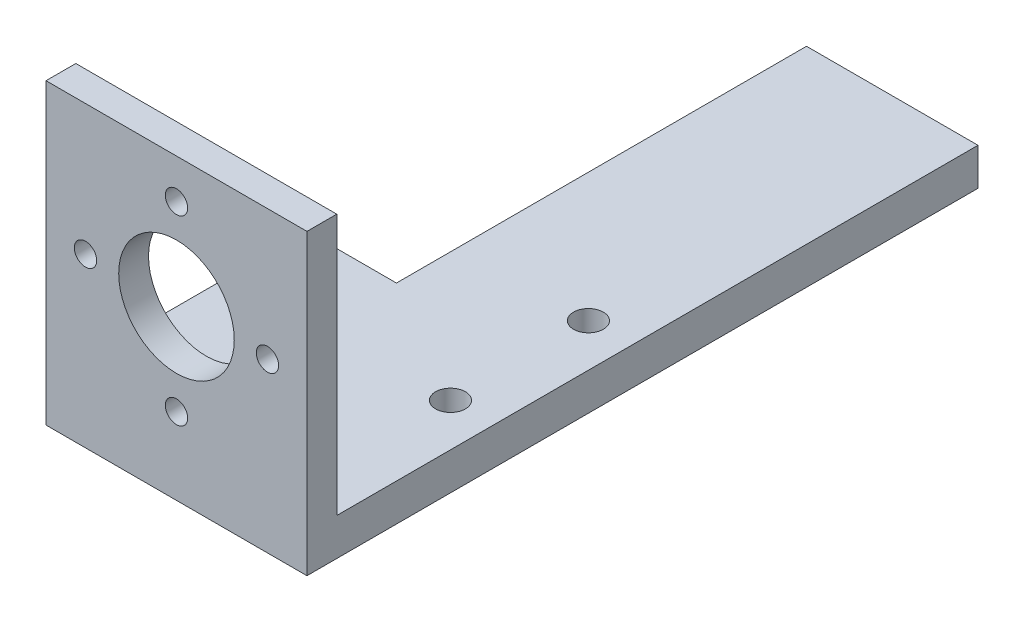
ISO-10303-21;
HEADER;
FILE_DESCRIPTION(('STEP AP214'),'2;1');
FILE_NAME('part.step','',(''),(''),'','','');
FILE_SCHEMA(('AUTOMOTIVE_DESIGN { 1 0 10303 214 1 1 1 1 }'));
ENDSEC;
DATA;
#1=APPLICATION_CONTEXT('core data for automotive mechanical design processes');
#2=APPLICATION_PROTOCOL_DEFINITION('international standard','automotive_design',2000,#1);
#3=PRODUCT_CONTEXT('',#1,'mechanical');
#4=PRODUCT('Part','Part','',(#3));
#5=PRODUCT_RELATED_PRODUCT_CATEGORY('part','',(#4));
#6=PRODUCT_DEFINITION_FORMATION('','',#4);
#7=PRODUCT_DEFINITION_CONTEXT('part definition',#1,'design');
#8=PRODUCT_DEFINITION('design','',#6,#7);
#9=PRODUCT_DEFINITION_SHAPE('','',#8);
#10=(LENGTH_UNIT() NAMED_UNIT(*) SI_UNIT(.MILLI.,.METRE.));
#11=(NAMED_UNIT(*) PLANE_ANGLE_UNIT() SI_UNIT($,.RADIAN.));
#12=(NAMED_UNIT(*) SI_UNIT($,.STERADIAN.) SOLID_ANGLE_UNIT());
#13=UNCERTAINTY_MEASURE_WITH_UNIT(LENGTH_MEASURE(1.E-05),#10,'distance_accuracy_value','');
#14=(GEOMETRIC_REPRESENTATION_CONTEXT(3) GLOBAL_UNCERTAINTY_ASSIGNED_CONTEXT((#13)) GLOBAL_UNIT_ASSIGNED_CONTEXT((#10,
#11,#12)) REPRESENTATION_CONTEXT('',''));
#15=CARTESIAN_POINT('',(0.,0.,0.));
#16=DIRECTION('',(0.,0.,1.));
#17=DIRECTION('',(1.,0.,0.));
#18=AXIS2_PLACEMENT_3D('',#15,#16,#17);
#19=CARTESIAN_POINT('',(-5.5,2.5,0.));
#20=DIRECTION('',(-1.,0.,0.));
#21=DIRECTION('',(0.,0.,1.));
#22=AXIS2_PLACEMENT_3D('',#19,#20,#21);
#23=PLANE('',#22);
#24=DIRECTION('',(0.,0.,-1.));
#25=VECTOR('',#24,1.);
#26=CARTESIAN_POINT('',(-5.5,-2.5,0.));
#27=LINE('',#26,#25);
#28=CARTESIAN_POINT('',(-5.5,-2.5,10.));
#29=VERTEX_POINT('',#28);
#30=CARTESIAN_POINT('',(-5.5,-2.5,-45.));
#31=VERTEX_POINT('',#30);
#32=EDGE_CURVE('E173',#29,#31,#27,.T.);
#33=ORIENTED_EDGE('',*,*,#32,.F.);
#34=DIRECTION('',(0.,-1.,0.));
#35=VECTOR('',#34,1.);
#36=CARTESIAN_POINT('',(-5.5,2.5,10.));
#37=LINE('',#36,#35);
#38=CARTESIAN_POINT('',(-5.5,2.5,10.));
#39=VERTEX_POINT('',#38);
#40=EDGE_CURVE('E11',#39,#29,#37,.T.);
#41=ORIENTED_EDGE('',*,*,#40,.F.);
#42=DIRECTION('',(0.,0.,-1.));
#43=VECTOR('',#42,1.);
#44=CARTESIAN_POINT('',(-5.5,2.5,0.));
#45=LINE('',#44,#43);
#46=CARTESIAN_POINT('',(-5.5,2.5,-45.));
#47=VERTEX_POINT('',#46);
#48=EDGE_CURVE('E154',#39,#47,#45,.T.);
#49=ORIENTED_EDGE('',*,*,#48,.T.);
#50=DIRECTION('',(0.,-1.,0.));
#51=VECTOR('',#50,1.);
#52=CARTESIAN_POINT('',(-5.5,2.5,-45.));
#53=LINE('',#52,#51);
#54=EDGE_CURVE('E59',#47,#31,#53,.T.);
#55=ORIENTED_EDGE('',*,*,#54,.T.);
#56=EDGE_LOOP('',(#33,#41,#49,#55));
#57=FACE_BOUND('',#56,.T.);
#58=ADVANCED_FACE('F35',(#57),#23,.T.);
#59=CARTESIAN_POINT('',(0.,2.5,10.));
#60=DIRECTION('',(0.,0.,-1.));
#61=DIRECTION('',(-1.,0.,0.));
#62=AXIS2_PLACEMENT_3D('',#59,#60,#61);
#63=PLANE('',#62);
#64=DIRECTION('',(1.,0.,0.));
#65=VECTOR('',#64,1.);
#66=CARTESIAN_POINT('',(0.,-2.5,10.));
#67=LINE('',#66,#65);
#68=CARTESIAN_POINT('',(-17.5,-2.5,10.));
#69=VERTEX_POINT('',#68);
#70=EDGE_CURVE('E175',#69,#29,#67,.T.);
#71=ORIENTED_EDGE('',*,*,#70,.F.);
#72=DIRECTION('',(0.,-1.,0.));
#73=VECTOR('',#72,1.);
#74=CARTESIAN_POINT('',(-17.5,2.5,10.));
#75=LINE('',#74,#73);
#76=CARTESIAN_POINT('',(-17.5,2.5,10.));
#77=VERTEX_POINT('',#76);
#78=EDGE_CURVE('E43',#77,#69,#75,.T.);
#79=ORIENTED_EDGE('',*,*,#78,.F.);
#80=DIRECTION('',(1.,0.,0.));
#81=VECTOR('',#80,1.);
#82=CARTESIAN_POINT('',(0.,2.5,10.));
#83=LINE('',#82,#81);
#84=EDGE_CURVE('E156',#77,#39,#83,.T.);
#85=ORIENTED_EDGE('',*,*,#84,.T.);
#86=ORIENTED_EDGE('',*,*,#40,.T.);
#87=EDGE_LOOP('',(#71,#79,#85,#86));
#88=FACE_BOUND('',#87,.T.);
#89=ADVANCED_FACE('F193',(#88),#63,.T.);
#90=CARTESIAN_POINT('',(-17.5,2.5,0.));
#91=DIRECTION('',(-1.,0.,0.));
#92=DIRECTION('',(0.,0.,1.));
#93=AXIS2_PLACEMENT_3D('',#90,#91,#92);
#94=PLANE('',#93);
#95=DIRECTION('',(0.,0.,-1.));
#96=VECTOR('',#95,1.);
#97=CARTESIAN_POINT('',(-17.5,-2.5,0.));
#98=LINE('',#97,#96);
#99=CARTESIAN_POINT('',(-17.5,-2.5,45.));
#100=VERTEX_POINT('',#99);
#101=EDGE_CURVE('E112',#100,#69,#98,.T.);
#102=ORIENTED_EDGE('',*,*,#101,.F.);
#103=DIRECTION('',(0.,-1.,0.));
#104=VECTOR('',#103,1.);
#105=CARTESIAN_POINT('',(-17.5,2.5,45.));
#106=LINE('',#105,#104);
#107=CARTESIAN_POINT('',(-17.5,37.5,45.));
#108=VERTEX_POINT('',#107);
#109=EDGE_CURVE('E105',#108,#100,#106,.T.);
#110=ORIENTED_EDGE('',*,*,#109,.F.);
#111=DIRECTION('',(0.,0.,1.));
#112=VECTOR('',#111,1.);
#113=CARTESIAN_POINT('',(-17.5,37.5,41.));
#114=LINE('',#113,#112);
#115=CARTESIAN_POINT('',(-17.5,37.5,41.));
#116=VERTEX_POINT('',#115);
#117=EDGE_CURVE('E110',#116,#108,#114,.T.);
#118=ORIENTED_EDGE('',*,*,#117,.F.);
#119=DIRECTION('',(0.,-1.,0.));
#120=VECTOR('',#119,1.);
#121=CARTESIAN_POINT('',(-17.5,37.5,41.));
#122=LINE('',#121,#120);
#123=CARTESIAN_POINT('',(-17.5,2.5,41.));
#124=VERTEX_POINT('',#123);
#125=EDGE_CURVE('E137',#116,#124,#122,.T.);
#126=ORIENTED_EDGE('',*,*,#125,.T.);
#127=DIRECTION('',(0.,0.,-1.));
#128=VECTOR('',#127,1.);
#129=CARTESIAN_POINT('',(-17.5,2.5,0.));
#130=LINE('',#129,#128);
#131=EDGE_CURVE('E159',#124,#77,#130,.T.);
#132=ORIENTED_EDGE('',*,*,#131,.T.);
#133=ORIENTED_EDGE('',*,*,#78,.T.);
#134=EDGE_LOOP('',(#102,#110,#118,#126,#132,#133));
#135=FACE_BOUND('',#134,.T.);
#136=ADVANCED_FACE('F107',(#135),#94,.T.);
#137=CARTESIAN_POINT('',(0.,2.5,45.));
#138=DIRECTION('',(0.,0.,1.));
#139=DIRECTION('',(1.,0.,0.));
#140=AXIS2_PLACEMENT_3D('',#137,#138,#139);
#141=PLANE('',#140);
#142=CARTESIAN_POINT('',(0.,32.2,45.));
#143=DIRECTION('',(0.,0.,1.));
#144=DIRECTION('',(1.,0.,0.));
#145=AXIS2_PLACEMENT_3D('',#142,#143,#144);
#146=CIRCLE('',#145,1.5);
#147=CARTESIAN_POINT('',(1.50000000000001,32.2,45.));
#148=VERTEX_POINT('',#147);
#149=EDGE_CURVE('E382',#148,#148,#146,.F.);
#150=ORIENTED_EDGE('',*,*,#149,.T.);
#151=EDGE_LOOP('',(#150));
#152=FACE_BOUND('',#151,.T.);
#153=CARTESIAN_POINT('',(12.2,20.,45.));
#154=DIRECTION('',(0.,0.,1.));
#155=DIRECTION('',(1.,0.,0.));
#156=AXIS2_PLACEMENT_3D('',#153,#154,#155);
#157=CIRCLE('',#156,1.5);
#158=CARTESIAN_POINT('',(13.7,20.,45.));
#159=VERTEX_POINT('',#158);
#160=EDGE_CURVE('E397',#159,#159,#157,.F.);
#161=ORIENTED_EDGE('',*,*,#160,.T.);
#162=EDGE_LOOP('',(#161));
#163=FACE_BOUND('',#162,.T.);
#164=CARTESIAN_POINT('',(0.,7.80000000000001,45.));
#165=DIRECTION('',(0.,0.,1.));
#166=DIRECTION('',(1.,0.,0.));
#167=AXIS2_PLACEMENT_3D('',#164,#165,#166);
#168=CIRCLE('',#167,1.5);
#169=CARTESIAN_POINT('',(1.50000000000001,7.80000000000001,45.));
#170=VERTEX_POINT('',#169);
#171=EDGE_CURVE('E391',#170,#170,#168,.F.);
#172=ORIENTED_EDGE('',*,*,#171,.T.);
#173=EDGE_LOOP('',(#172));
#174=FACE_BOUND('',#173,.T.);
#175=CARTESIAN_POINT('',(-12.2,20.,45.));
#176=DIRECTION('',(0.,0.,1.));
#177=DIRECTION('',(1.,0.,0.));
#178=AXIS2_PLACEMENT_3D('',#175,#176,#177);
#179=CIRCLE('',#178,1.5);
#180=CARTESIAN_POINT('',(-10.7,20.,45.));
#181=VERTEX_POINT('',#180);
#182=EDGE_CURVE('E133',#181,#181,#179,.F.);
#183=ORIENTED_EDGE('',*,*,#182,.T.);
#184=EDGE_LOOP('',(#183));
#185=FACE_BOUND('',#184,.T.);
#186=CARTESIAN_POINT('',(0.,20.,45.));
#187=DIRECTION('',(0.,0.,1.));
#188=DIRECTION('',(1.,0.,0.));
#189=AXIS2_PLACEMENT_3D('',#186,#187,#188);
#190=CIRCLE('',#189,7.75);
#191=CARTESIAN_POINT('',(7.75000000000001,20.,45.));
#192=VERTEX_POINT('',#191);
#193=EDGE_CURVE('E402',#192,#192,#190,.F.);
#194=ORIENTED_EDGE('',*,*,#193,.T.);
#195=EDGE_LOOP('',(#194));
#196=FACE_BOUND('',#195,.T.);
#197=DIRECTION('',(-1.,0.,0.));
#198=VECTOR('',#197,1.);
#199=CARTESIAN_POINT('',(0.,-2.5,45.));
#200=LINE('',#199,#198);
#201=CARTESIAN_POINT('',(17.5,-2.5,45.));
#202=VERTEX_POINT('',#201);
#203=EDGE_CURVE('E179',#202,#100,#200,.T.);
#204=ORIENTED_EDGE('',*,*,#203,.F.);
#205=DIRECTION('',(0.,-1.,0.));
#206=VECTOR('',#205,1.);
#207=CARTESIAN_POINT('',(17.5,2.5,45.));
#208=LINE('',#207,#206);
#209=CARTESIAN_POINT('',(17.5,37.5,45.));
#210=VERTEX_POINT('',#209);
#211=EDGE_CURVE('E116',#210,#202,#208,.T.);
#212=ORIENTED_EDGE('',*,*,#211,.F.);
#213=DIRECTION('',(1.,0.,0.));
#214=VECTOR('',#213,1.);
#215=CARTESIAN_POINT('',(-17.5,37.5,45.));
#216=LINE('',#215,#214);
#217=EDGE_CURVE('E119',#108,#210,#216,.T.);
#218=ORIENTED_EDGE('',*,*,#217,.F.);
#219=ORIENTED_EDGE('',*,*,#109,.T.);
#220=EDGE_LOOP('',(#204,#212,#218,#219));
#221=FACE_BOUND('',#220,.T.);
#222=ADVANCED_FACE('F120',(#152,#163,#174,#185,#196,#221),#141,.T.);
#223=CARTESIAN_POINT('',(17.5,2.5,0.));
#224=DIRECTION('',(1.,0.,0.));
#225=DIRECTION('',(0.,0.,-1.));
#226=AXIS2_PLACEMENT_3D('',#223,#224,#225);
#227=PLANE('',#226);
#228=DIRECTION('',(0.,0.,1.));
#229=VECTOR('',#228,1.);
#230=CARTESIAN_POINT('',(17.5,-2.5,0.));
#231=LINE('',#230,#229);
#232=CARTESIAN_POINT('',(17.5,-2.5,-45.));
#233=VERTEX_POINT('',#232);
#234=EDGE_CURVE('E181',#233,#202,#231,.T.);
#235=ORIENTED_EDGE('',*,*,#234,.F.);
#236=DIRECTION('',(0.,-1.,0.));
#237=VECTOR('',#236,1.);
#238=CARTESIAN_POINT('',(17.5,2.5,-45.));
#239=LINE('',#238,#237);
#240=CARTESIAN_POINT('',(17.5,2.5,-45.));
#241=VERTEX_POINT('',#240);
#242=EDGE_CURVE('E187',#241,#233,#239,.T.);
#243=ORIENTED_EDGE('',*,*,#242,.F.);
#244=DIRECTION('',(0.,0.,1.));
#245=VECTOR('',#244,1.);
#246=CARTESIAN_POINT('',(17.5,2.5,0.));
#247=LINE('',#246,#245);
#248=CARTESIAN_POINT('',(17.5,2.5,41.));
#249=VERTEX_POINT('',#248);
#250=EDGE_CURVE('E161',#241,#249,#247,.T.);
#251=ORIENTED_EDGE('',*,*,#250,.T.);
#252=DIRECTION('',(0.,-1.,0.));
#253=VECTOR('',#252,1.);
#254=CARTESIAN_POINT('',(17.5,37.5,41.));
#255=LINE('',#254,#253);
#256=CARTESIAN_POINT('',(17.5,37.5,41.));
#257=VERTEX_POINT('',#256);
#258=EDGE_CURVE('E140',#257,#249,#255,.T.);
#259=ORIENTED_EDGE('',*,*,#258,.F.);
#260=DIRECTION('',(0.,0.,-1.));
#261=VECTOR('',#260,1.);
#262=CARTESIAN_POINT('',(17.5,37.5,45.));
#263=LINE('',#262,#261);
#264=EDGE_CURVE('E123',#210,#257,#263,.T.);
#265=ORIENTED_EDGE('',*,*,#264,.F.);
#266=ORIENTED_EDGE('',*,*,#211,.T.);
#267=EDGE_LOOP('',(#235,#243,#251,#259,#265,#266));
#268=FACE_BOUND('',#267,.T.);
#269=ADVANCED_FACE('F198',(#268),#227,.T.);
#270=CARTESIAN_POINT('',(-11.75,2.5,20.));
#271=DIRECTION('',(0.,-1.,0.));
#272=DIRECTION('',(0.,0.,-1.));
#273=AXIS2_PLACEMENT_3D('',#270,#271,#272);
#274=CYLINDRICAL_SURFACE('',#273,2.);
#275=CARTESIAN_POINT('',(-11.75,2.5,20.));
#276=DIRECTION('',(0.,1.,0.));
#277=DIRECTION('',(0.,0.,1.));
#278=AXIS2_PLACEMENT_3D('',#275,#276,#277);
#279=CIRCLE('',#278,2.);
#280=CARTESIAN_POINT('',(-11.75,2.5,22.));
#281=VERTEX_POINT('',#280);
#282=EDGE_CURVE('E151',#281,#281,#279,.T.);
#283=ORIENTED_EDGE('',*,*,#282,.T.);
#284=EDGE_LOOP('',(#283));
#285=FACE_BOUND('',#284,.T.);
#286=CARTESIAN_POINT('',(-11.75,-2.5,20.));
#287=DIRECTION('',(0.,1.,0.));
#288=DIRECTION('',(0.,0.,1.));
#289=AXIS2_PLACEMENT_3D('',#286,#287,#288);
#290=CIRCLE('',#289,2.);
#291=CARTESIAN_POINT('',(-11.75,-2.5,22.));
#292=VERTEX_POINT('',#291);
#293=EDGE_CURVE('E170',#292,#292,#290,.T.);
#294=ORIENTED_EDGE('',*,*,#293,.F.);
#295=EDGE_LOOP('',(#294));
#296=FACE_BOUND('',#295,.T.);
#297=ADVANCED_FACE('F225',(#285,#296),#274,.F.);
#298=CARTESIAN_POINT('',(11.75,2.5,1.5));
#299=DIRECTION('',(0.,-1.,0.));
#300=DIRECTION('',(0.,0.,-1.));
#301=AXIS2_PLACEMENT_3D('',#298,#299,#300);
#302=CYLINDRICAL_SURFACE('',#301,2.);
#303=CARTESIAN_POINT('',(11.75,2.5,1.5));
#304=DIRECTION('',(0.,1.,0.));
#305=DIRECTION('',(0.,0.,1.));
#306=AXIS2_PLACEMENT_3D('',#303,#304,#305);
#307=CIRCLE('',#306,2.);
#308=CARTESIAN_POINT('',(11.75,2.5,3.5));
#309=VERTEX_POINT('',#308);
#310=EDGE_CURVE('E147',#309,#309,#307,.T.);
#311=ORIENTED_EDGE('',*,*,#310,.T.);
#312=EDGE_LOOP('',(#311));
#313=FACE_BOUND('',#312,.T.);
#314=CARTESIAN_POINT('',(11.75,-2.5,1.5));
#315=DIRECTION('',(0.,1.,0.));
#316=DIRECTION('',(0.,0.,1.));
#317=AXIS2_PLACEMENT_3D('',#314,#315,#316);
#318=CIRCLE('',#317,2.);
#319=CARTESIAN_POINT('',(11.75,-2.5,3.5));
#320=VERTEX_POINT('',#319);
#321=EDGE_CURVE('E167',#320,#320,#318,.T.);
#322=ORIENTED_EDGE('',*,*,#321,.F.);
#323=EDGE_LOOP('',(#322));
#324=FACE_BOUND('',#323,.T.);
#325=ADVANCED_FACE('F227',(#313,#324),#302,.F.);
#326=CARTESIAN_POINT('',(11.75,2.5,20.));
#327=DIRECTION('',(0.,-1.,0.));
#328=DIRECTION('',(0.,0.,-1.));
#329=AXIS2_PLACEMENT_3D('',#326,#327,#328);
#330=CYLINDRICAL_SURFACE('',#329,2.);
#331=CARTESIAN_POINT('',(11.75,2.5,20.));
#332=DIRECTION('',(0.,1.,0.));
#333=DIRECTION('',(0.,0.,1.));
#334=AXIS2_PLACEMENT_3D('',#331,#332,#333);
#335=CIRCLE('',#334,2.);
#336=CARTESIAN_POINT('',(11.75,2.5,22.));
#337=VERTEX_POINT('',#336);
#338=EDGE_CURVE('E144',#337,#337,#335,.T.);
#339=ORIENTED_EDGE('',*,*,#338,.T.);
#340=EDGE_LOOP('',(#339));
#341=FACE_BOUND('',#340,.T.);
#342=CARTESIAN_POINT('',(11.75,-2.5,20.));
#343=DIRECTION('',(0.,1.,0.));
#344=DIRECTION('',(0.,0.,1.));
#345=AXIS2_PLACEMENT_3D('',#342,#343,#344);
#346=CIRCLE('',#345,2.);
#347=CARTESIAN_POINT('',(11.75,-2.5,22.));
#348=VERTEX_POINT('',#347);
#349=EDGE_CURVE('E143',#348,#348,#346,.T.);
#350=ORIENTED_EDGE('',*,*,#349,.F.);
#351=EDGE_LOOP('',(#350));
#352=FACE_BOUND('',#351,.T.);
#353=ADVANCED_FACE('F37',(#341,#352),#330,.F.);
#354=CARTESIAN_POINT('',(0.,2.5,-45.));
#355=DIRECTION('',(0.,0.,-1.));
#356=DIRECTION('',(-1.,0.,0.));
#357=AXIS2_PLACEMENT_3D('',#354,#355,#356);
#358=PLANE('',#357);
#359=DIRECTION('',(1.,0.,0.));
#360=VECTOR('',#359,1.);
#361=CARTESIAN_POINT('',(0.,-2.5,-45.));
#362=LINE('',#361,#360);
#363=EDGE_CURVE('E148',#31,#233,#362,.T.);
#364=ORIENTED_EDGE('',*,*,#363,.F.);
#365=ORIENTED_EDGE('',*,*,#54,.F.);
#366=DIRECTION('',(1.,0.,0.));
#367=VECTOR('',#366,1.);
#368=CARTESIAN_POINT('',(0.,2.5,-45.));
#369=LINE('',#368,#367);
#370=EDGE_CURVE('E163',#47,#241,#369,.T.);
#371=ORIENTED_EDGE('',*,*,#370,.T.);
#372=ORIENTED_EDGE('',*,*,#242,.T.);
#373=EDGE_LOOP('',(#364,#365,#371,#372));
#374=FACE_BOUND('',#373,.T.);
#375=ADVANCED_FACE('F234',(#374),#358,.T.);
#376=CARTESIAN_POINT('',(0.,2.5,0.));
#377=DIRECTION('',(0.,1.,0.));
#378=DIRECTION('',(0.,0.,1.));
#379=AXIS2_PLACEMENT_3D('',#376,#377,#378);
#380=PLANE('',#379);
#381=DIRECTION('',(-1.,0.,0.));
#382=VECTOR('',#381,1.);
#383=CARTESIAN_POINT('',(17.5,2.5,41.));
#384=LINE('',#383,#382);
#385=EDGE_CURVE('E50',#249,#124,#384,.T.);
#386=ORIENTED_EDGE('',*,*,#385,.F.);
#387=ORIENTED_EDGE('',*,*,#250,.F.);
#388=ORIENTED_EDGE('',*,*,#370,.F.);
#389=ORIENTED_EDGE('',*,*,#48,.F.);
#390=ORIENTED_EDGE('',*,*,#84,.F.);
#391=ORIENTED_EDGE('',*,*,#131,.F.);
#392=EDGE_LOOP('',(#386,#387,#388,#389,#390,#391));
#393=FACE_BOUND('',#392,.T.);
#394=ORIENTED_EDGE('',*,*,#338,.F.);
#395=EDGE_LOOP('',(#394));
#396=FACE_BOUND('',#395,.T.);
#397=ORIENTED_EDGE('',*,*,#310,.F.);
#398=EDGE_LOOP('',(#397));
#399=FACE_BOUND('',#398,.T.);
#400=ORIENTED_EDGE('',*,*,#282,.F.);
#401=EDGE_LOOP('',(#400));
#402=FACE_BOUND('',#401,.T.);
#403=ADVANCED_FACE('F211',(#393,#396,#399,#402),#380,.T.);
#404=CARTESIAN_POINT('',(0.,-2.5,0.));
#405=DIRECTION('',(0.,1.,0.));
#406=DIRECTION('',(0.,0.,1.));
#407=AXIS2_PLACEMENT_3D('',#404,#405,#406);
#408=PLANE('',#407);
#409=ORIENTED_EDGE('',*,*,#349,.T.);
#410=EDGE_LOOP('',(#409));
#411=FACE_BOUND('',#410,.T.);
#412=ORIENTED_EDGE('',*,*,#321,.T.);
#413=EDGE_LOOP('',(#412));
#414=FACE_BOUND('',#413,.T.);
#415=ORIENTED_EDGE('',*,*,#293,.T.);
#416=EDGE_LOOP('',(#415));
#417=FACE_BOUND('',#416,.T.);
#418=ORIENTED_EDGE('',*,*,#32,.T.);
#419=ORIENTED_EDGE('',*,*,#363,.T.);
#420=ORIENTED_EDGE('',*,*,#234,.T.);
#421=ORIENTED_EDGE('',*,*,#203,.T.);
#422=ORIENTED_EDGE('',*,*,#101,.T.);
#423=ORIENTED_EDGE('',*,*,#70,.T.);
#424=EDGE_LOOP('',(#418,#419,#420,#421,#422,#423));
#425=FACE_BOUND('',#424,.T.);
#426=ADVANCED_FACE('F195',(#411,#414,#417,#425),#408,.F.);
#427=CARTESIAN_POINT('',(17.5,37.5,41.));
#428=DIRECTION('',(0.,0.,1.));
#429=DIRECTION('',(1.,0.,0.));
#430=AXIS2_PLACEMENT_3D('',#427,#428,#429);
#431=PLANE('',#430);
#432=CARTESIAN_POINT('',(0.,32.2,41.));
#433=DIRECTION('',(0.,0.,-1.));
#434=DIRECTION('',(-1.,0.,0.));
#435=AXIS2_PLACEMENT_3D('',#432,#433,#434);
#436=CIRCLE('',#435,1.5);
#437=CARTESIAN_POINT('',(-1.49999999999999,32.2,41.));
#438=VERTEX_POINT('',#437);
#439=EDGE_CURVE('E130',#438,#438,#436,.T.);
#440=ORIENTED_EDGE('',*,*,#439,.F.);
#441=EDGE_LOOP('',(#440));
#442=FACE_BOUND('',#441,.T.);
#443=CARTESIAN_POINT('',(12.2,20.,41.));
#444=DIRECTION('',(0.,0.,-1.));
#445=DIRECTION('',(-1.,0.,0.));
#446=AXIS2_PLACEMENT_3D('',#443,#444,#445);
#447=CIRCLE('',#446,1.5);
#448=CARTESIAN_POINT('',(10.7,20.,41.));
#449=VERTEX_POINT('',#448);
#450=EDGE_CURVE('E394',#449,#449,#447,.T.);
#451=ORIENTED_EDGE('',*,*,#450,.F.);
#452=EDGE_LOOP('',(#451));
#453=FACE_BOUND('',#452,.T.);
#454=CARTESIAN_POINT('',(0.,7.80000000000001,41.));
#455=DIRECTION('',(0.,0.,-1.));
#456=DIRECTION('',(-1.,0.,0.));
#457=AXIS2_PLACEMENT_3D('',#454,#455,#456);
#458=CIRCLE('',#457,1.5);
#459=CARTESIAN_POINT('',(-1.49999999999999,7.80000000000001,41.));
#460=VERTEX_POINT('',#459);
#461=EDGE_CURVE('E388',#460,#460,#458,.T.);
#462=ORIENTED_EDGE('',*,*,#461,.F.);
#463=EDGE_LOOP('',(#462));
#464=FACE_BOUND('',#463,.T.);
#465=CARTESIAN_POINT('',(-12.2,20.,41.));
#466=DIRECTION('',(0.,0.,-1.));
#467=DIRECTION('',(-1.,0.,0.));
#468=AXIS2_PLACEMENT_3D('',#465,#466,#467);
#469=CIRCLE('',#468,1.5);
#470=CARTESIAN_POINT('',(-13.7,20.,41.));
#471=VERTEX_POINT('',#470);
#472=EDGE_CURVE('E404',#471,#471,#469,.T.);
#473=ORIENTED_EDGE('',*,*,#472,.F.);
#474=EDGE_LOOP('',(#473));
#475=FACE_BOUND('',#474,.T.);
#476=CARTESIAN_POINT('',(0.,20.,41.));
#477=DIRECTION('',(0.,0.,-1.));
#478=DIRECTION('',(-1.,0.,0.));
#479=AXIS2_PLACEMENT_3D('',#476,#477,#478);
#480=CIRCLE('',#479,7.75);
#481=CARTESIAN_POINT('',(-7.74999999999999,20.,41.));
#482=VERTEX_POINT('',#481);
#483=EDGE_CURVE('E385',#482,#482,#480,.T.);
#484=ORIENTED_EDGE('',*,*,#483,.F.);
#485=EDGE_LOOP('',(#484));
#486=FACE_BOUND('',#485,.T.);
#487=ORIENTED_EDGE('',*,*,#385,.T.);
#488=ORIENTED_EDGE('',*,*,#125,.F.);
#489=DIRECTION('',(-1.,0.,0.));
#490=VECTOR('',#489,1.);
#491=CARTESIAN_POINT('',(17.5,37.5,41.));
#492=LINE('',#491,#490);
#493=EDGE_CURVE('E127',#257,#116,#492,.T.);
#494=ORIENTED_EDGE('',*,*,#493,.F.);
#495=ORIENTED_EDGE('',*,*,#258,.T.);
#496=EDGE_LOOP('',(#487,#488,#494,#495));
#497=FACE_BOUND('',#496,.T.);
#498=ADVANCED_FACE('F201',(#442,#453,#464,#475,#486,#497),#431,.F.);
#499=CARTESIAN_POINT('',(0.,37.5,0.));
#500=DIRECTION('',(0.,1.,0.));
#501=DIRECTION('',(0.,0.,1.));
#502=AXIS2_PLACEMENT_3D('',#499,#500,#501);
#503=PLANE('',#502);
#504=ORIENTED_EDGE('',*,*,#117,.T.);
#505=ORIENTED_EDGE('',*,*,#217,.T.);
#506=ORIENTED_EDGE('',*,*,#264,.T.);
#507=ORIENTED_EDGE('',*,*,#493,.T.);
#508=EDGE_LOOP('',(#504,#505,#506,#507));
#509=FACE_BOUND('',#508,.T.);
#510=ADVANCED_FACE('F125',(#509),#503,.T.);
#511=CARTESIAN_POINT('',(0.,20.,45.001));
#512=DIRECTION('',(0.,0.,-1.));
#513=DIRECTION('',(-1.,0.,0.));
#514=AXIS2_PLACEMENT_3D('',#511,#512,#513);
#515=CYLINDRICAL_SURFACE('',#514,7.75);
#516=ORIENTED_EDGE('',*,*,#193,.F.);
#517=EDGE_LOOP('',(#516));
#518=FACE_BOUND('',#517,.T.);
#519=ORIENTED_EDGE('',*,*,#483,.T.);
#520=EDGE_LOOP('',(#519));
#521=FACE_BOUND('',#520,.T.);
#522=ADVANCED_FACE('F209',(#518,#521),#515,.F.);
#523=CARTESIAN_POINT('',(-12.2,20.,45.001));
#524=DIRECTION('',(0.,0.,-1.));
#525=DIRECTION('',(-1.,0.,0.));
#526=AXIS2_PLACEMENT_3D('',#523,#524,#525);
#527=CYLINDRICAL_SURFACE('',#526,1.5);
#528=ORIENTED_EDGE('',*,*,#182,.F.);
#529=EDGE_LOOP('',(#528));
#530=FACE_BOUND('',#529,.T.);
#531=ORIENTED_EDGE('',*,*,#472,.T.);
#532=EDGE_LOOP('',(#531));
#533=FACE_BOUND('',#532,.T.);
#534=ADVANCED_FACE('F335',(#530,#533),#527,.F.);
#535=CARTESIAN_POINT('',(0.,7.80000000000001,45.001));
#536=DIRECTION('',(0.,0.,-1.));
#537=DIRECTION('',(-1.,0.,0.));
#538=AXIS2_PLACEMENT_3D('',#535,#536,#537);
#539=CYLINDRICAL_SURFACE('',#538,1.5);
#540=ORIENTED_EDGE('',*,*,#171,.F.);
#541=EDGE_LOOP('',(#540));
#542=FACE_BOUND('',#541,.T.);
#543=ORIENTED_EDGE('',*,*,#461,.T.);
#544=EDGE_LOOP('',(#543));
#545=FACE_BOUND('',#544,.T.);
#546=ADVANCED_FACE('F344',(#542,#545),#539,.F.);
#547=CARTESIAN_POINT('',(12.2,20.,45.001));
#548=DIRECTION('',(0.,0.,-1.));
#549=DIRECTION('',(-1.,0.,0.));
#550=AXIS2_PLACEMENT_3D('',#547,#548,#549);
#551=CYLINDRICAL_SURFACE('',#550,1.5);
#552=ORIENTED_EDGE('',*,*,#160,.F.);
#553=EDGE_LOOP('',(#552));
#554=FACE_BOUND('',#553,.T.);
#555=ORIENTED_EDGE('',*,*,#450,.T.);
#556=EDGE_LOOP('',(#555));
#557=FACE_BOUND('',#556,.T.);
#558=ADVANCED_FACE('F353',(#554,#557),#551,.F.);
#559=CARTESIAN_POINT('',(0.,32.2,45.001));
#560=DIRECTION('',(0.,0.,-1.));
#561=DIRECTION('',(-1.,0.,0.));
#562=AXIS2_PLACEMENT_3D('',#559,#560,#561);
#563=CYLINDRICAL_SURFACE('',#562,1.5);
#564=ORIENTED_EDGE('',*,*,#149,.F.);
#565=EDGE_LOOP('',(#564));
#566=FACE_BOUND('',#565,.T.);
#567=ORIENTED_EDGE('',*,*,#439,.T.);
#568=EDGE_LOOP('',(#567));
#569=FACE_BOUND('',#568,.T.);
#570=ADVANCED_FACE('F362',(#566,#569),#563,.F.);
#571=CLOSED_SHELL('',(#58,#89,#136,#222,#269,#297,#325,#353,#375,#403,#426,#498,#510,#522,#534,
#546,#558,#570));
#572=MANIFOLD_SOLID_BREP('B2',#571);
#573=ADVANCED_BREP_SHAPE_REPRESENTATION('',(#18,#572),#14);
#574=SHAPE_DEFINITION_REPRESENTATION(#9,#573);
ENDSEC;
END-ISO-10303-21;
